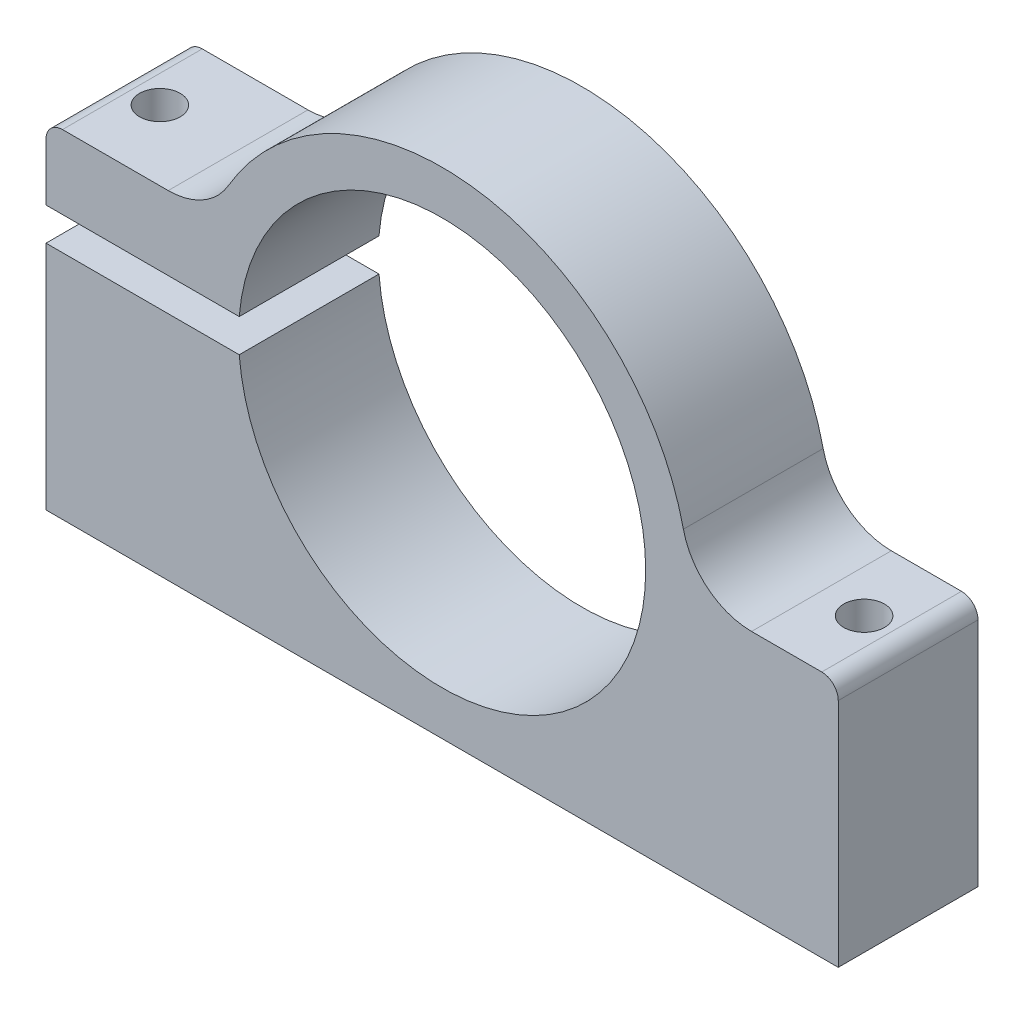
ISO-10303-21;
HEADER;
FILE_DESCRIPTION(('STEP AP214'),'2;1');
FILE_NAME('part.step','',(''),(''),'','','');
FILE_SCHEMA(('AUTOMOTIVE_DESIGN { 1 0 10303 214 1 1 1 1 }'));
ENDSEC;
DATA;
#1=APPLICATION_CONTEXT('core data for automotive mechanical design processes');
#2=APPLICATION_PROTOCOL_DEFINITION('international standard','automotive_design',2000,#1);
#3=PRODUCT_CONTEXT('',#1,'mechanical');
#4=PRODUCT('Part','Part','',(#3));
#5=PRODUCT_RELATED_PRODUCT_CATEGORY('part','',(#4));
#6=PRODUCT_DEFINITION_FORMATION('','',#4);
#7=PRODUCT_DEFINITION_CONTEXT('part definition',#1,'design');
#8=PRODUCT_DEFINITION('design','',#6,#7);
#9=PRODUCT_DEFINITION_SHAPE('','',#8);
#10=(LENGTH_UNIT() NAMED_UNIT(*) SI_UNIT(.MILLI.,.METRE.));
#11=(NAMED_UNIT(*) PLANE_ANGLE_UNIT() SI_UNIT($,.RADIAN.));
#12=(NAMED_UNIT(*) SI_UNIT($,.STERADIAN.) SOLID_ANGLE_UNIT());
#13=UNCERTAINTY_MEASURE_WITH_UNIT(LENGTH_MEASURE(1.E-05),#10,'distance_accuracy_value','');
#14=(GEOMETRIC_REPRESENTATION_CONTEXT(3) GLOBAL_UNCERTAINTY_ASSIGNED_CONTEXT((#13)) GLOBAL_UNIT_ASSIGNED_CONTEXT((#10,
#11,#12)) REPRESENTATION_CONTEXT('',''));
#15=CARTESIAN_POINT('',(0.,0.,0.));
#16=DIRECTION('',(0.,0.,1.));
#17=DIRECTION('',(1.,0.,0.));
#18=AXIS2_PLACEMENT_3D('',#15,#16,#17);
#19=CARTESIAN_POINT('',(-22.4298996876937,1.5,-12.7));
#20=DIRECTION('',(0.,1.,0.));
#21=DIRECTION('',(-1.,0.,0.));
#22=AXIS2_PLACEMENT_3D('',#19,#20,#21);
#23=PLANE('',#22);
#24=CARTESIAN_POINT('',(-32.,1.5,-6.35));
#25=DIRECTION('',(0.,1.,0.));
#26=DIRECTION('',(-1.,0.,0.));
#27=AXIS2_PLACEMENT_3D('',#24,#25,#26);
#28=CIRCLE('',#27,1.85);
#29=CARTESIAN_POINT('',(-33.85,1.5,-6.35));
#30=VERTEX_POINT('',#29);
#31=EDGE_CURVE('E152',#30,#30,#28,.T.);
#32=ORIENTED_EDGE('',*,*,#31,.T.);
#33=EDGE_LOOP('',(#32));
#34=FACE_BOUND('',#33,.T.);
#35=DIRECTION('',(-1.,0.,0.));
#36=VECTOR('',#35,1.);
#37=CARTESIAN_POINT('',(-22.4298996876937,1.5,0.));
#38=LINE('',#37,#36);
#39=CARTESIAN_POINT('',(-18.4390889145858,1.5,0.));
#40=VERTEX_POINT('',#39);
#41=CARTESIAN_POINT('',(-36.,1.5,0.));
#42=VERTEX_POINT('',#41);
#43=EDGE_CURVE('E141',#40,#42,#38,.T.);
#44=ORIENTED_EDGE('',*,*,#43,.T.);
#45=DIRECTION('',(0.,0.,1.));
#46=VECTOR('',#45,1.);
#47=CARTESIAN_POINT('',(-36.,1.5,-12.7));
#48=LINE('',#47,#46);
#49=CARTESIAN_POINT('',(-36.,1.5,-12.7));
#50=VERTEX_POINT('',#49);
#51=EDGE_CURVE('E201',#50,#42,#48,.T.);
#52=ORIENTED_EDGE('',*,*,#51,.F.);
#53=DIRECTION('',(-1.,0.,0.));
#54=VECTOR('',#53,1.);
#55=CARTESIAN_POINT('',(-22.4298996876937,1.5,-12.7));
#56=LINE('',#55,#54);
#57=CARTESIAN_POINT('',(-18.4390889145858,1.50000000000001,-12.7));
#58=VERTEX_POINT('',#57);
#59=EDGE_CURVE('E180',#58,#50,#56,.T.);
#60=ORIENTED_EDGE('',*,*,#59,.F.);
#61=DIRECTION('',(0.,0.,1.));
#62=VECTOR('',#61,1.);
#63=CARTESIAN_POINT('',(-18.4390889145858,1.5,-12.7));
#64=LINE('',#63,#62);
#65=EDGE_CURVE('E151',#58,#40,#64,.T.);
#66=ORIENTED_EDGE('',*,*,#65,.T.);
#67=EDGE_LOOP('',(#44,#52,#60,#66));
#68=FACE_BOUND('',#67,.T.);
#69=ADVANCED_FACE('F30',(#34,#68),#23,.F.);
#70=CARTESIAN_POINT('',(-36.,1.5,-12.7));
#71=DIRECTION('',(1.,0.,0.));
#72=DIRECTION('',(0.,0.,-1.));
#73=AXIS2_PLACEMENT_3D('',#70,#71,#72);
#74=PLANE('',#73);
#75=DIRECTION('',(0.,1.,0.));
#76=VECTOR('',#75,1.);
#77=CARTESIAN_POINT('',(-36.,1.5,0.));
#78=LINE('',#77,#76);
#79=CARTESIAN_POINT('',(-36.,6.69101756633617,0.));
#80=VERTEX_POINT('',#79);
#81=EDGE_CURVE('E198',#42,#80,#78,.T.);
#82=ORIENTED_EDGE('',*,*,#81,.T.);
#83=DIRECTION('',(0.,0.,1.));
#84=VECTOR('',#83,1.);
#85=CARTESIAN_POINT('',(-36.,6.69101756633617,-12.7));
#86=LINE('',#85,#84);
#87=CARTESIAN_POINT('',(-36.,6.69101756633617,-12.7));
#88=VERTEX_POINT('',#87);
#89=EDGE_CURVE('E38',#80,#88,#86,.F.);
#90=ORIENTED_EDGE('',*,*,#89,.T.);
#91=DIRECTION('',(0.,1.,0.));
#92=VECTOR('',#91,1.);
#93=CARTESIAN_POINT('',(-36.,1.5,-12.7));
#94=LINE('',#93,#92);
#95=EDGE_CURVE('E178',#50,#88,#94,.T.);
#96=ORIENTED_EDGE('',*,*,#95,.F.);
#97=ORIENTED_EDGE('',*,*,#51,.T.);
#98=EDGE_LOOP('',(#82,#90,#96,#97));
#99=FACE_BOUND('',#98,.T.);
#100=ADVANCED_FACE('F322',(#99),#74,.F.);
#101=CARTESIAN_POINT('',(-36.,8.19101756633617,-12.7));
#102=DIRECTION('',(0.,-1.,0.));
#103=DIRECTION('',(1.,0.,0.));
#104=AXIS2_PLACEMENT_3D('',#101,#102,#103);
#105=PLANE('',#104);
#106=CARTESIAN_POINT('',(-32.,8.19101756633617,-6.35));
#107=DIRECTION('',(0.,1.,0.));
#108=DIRECTION('',(-1.,0.,0.));
#109=AXIS2_PLACEMENT_3D('',#106,#107,#108);
#110=CIRCLE('',#109,1.85);
#111=CARTESIAN_POINT('',(-33.85,8.19101756633617,-6.35));
#112=VERTEX_POINT('',#111);
#113=EDGE_CURVE('E291',#112,#112,#110,.T.);
#114=ORIENTED_EDGE('',*,*,#113,.F.);
#115=EDGE_LOOP('',(#114));
#116=FACE_BOUND('',#115,.T.);
#117=DIRECTION('',(1.,0.,0.));
#118=VECTOR('',#117,1.);
#119=CARTESIAN_POINT('',(-36.,8.19101756633617,-12.7));
#120=LINE('',#119,#118);
#121=CARTESIAN_POINT('',(-34.5,8.19101756633617,-12.7));
#122=VERTEX_POINT('',#121);
#123=CARTESIAN_POINT('',(-24.8943308432965,8.19101756633617,-12.7));
#124=VERTEX_POINT('',#123);
#125=EDGE_CURVE('E176',#122,#124,#120,.T.);
#126=ORIENTED_EDGE('',*,*,#125,.F.);
#127=DIRECTION('',(0.,0.,1.));
#128=VECTOR('',#127,1.);
#129=CARTESIAN_POINT('',(-34.5,8.19101756633617,-12.7));
#130=LINE('',#129,#128);
#131=CARTESIAN_POINT('',(-34.5,8.19101756633617,0.));
#132=VERTEX_POINT('',#131);
#133=EDGE_CURVE('E243',#122,#132,#130,.T.);
#134=ORIENTED_EDGE('',*,*,#133,.T.);
#135=DIRECTION('',(1.,0.,0.));
#136=VECTOR('',#135,1.);
#137=CARTESIAN_POINT('',(-36.,8.19101756633617,0.));
#138=LINE('',#137,#136);
#139=CARTESIAN_POINT('',(-24.8943308432965,8.19101756633617,0.));
#140=VERTEX_POINT('',#139);
#141=EDGE_CURVE('E196',#132,#140,#138,.T.);
#142=ORIENTED_EDGE('',*,*,#141,.T.);
#143=DIRECTION('',(0.,0.,1.));
#144=VECTOR('',#143,1.);
#145=CARTESIAN_POINT('',(-24.8943308432965,8.19101756633617,-12.7));
#146=LINE('',#145,#144);
#147=EDGE_CURVE('E226',#140,#124,#146,.F.);
#148=ORIENTED_EDGE('',*,*,#147,.T.);
#149=EDGE_LOOP('',(#126,#134,#142,#148));
#150=FACE_BOUND('',#149,.T.);
#151=ADVANCED_FACE('F249',(#116,#150),#105,.F.);
#152=CARTESIAN_POINT('',(0.,0.,-12.7));
#153=DIRECTION('',(0.,0.,1.));
#154=DIRECTION('',(1.,0.,0.));
#155=AXIS2_PLACEMENT_3D('',#152,#153,#154);
#156=CYLINDRICAL_SURFACE('',#155,22.48);
#157=CARTESIAN_POINT('',(0.,0.,-12.7));
#158=DIRECTION('',(0.,0.,1.));
#159=DIRECTION('',(1.,0.,0.));
#160=AXIS2_PLACEMENT_3D('',#157,#158,#159);
#161=CIRCLE('',#160,22.48);
#162=CARTESIAN_POINT('',(21.9279350173925,4.95137010058966,-12.7));
#163=VERTEX_POINT('',#162);
#164=CARTESIAN_POINT('',(-19.4111882538087,11.3382613559222,-12.7));
#165=VERTEX_POINT('',#164);
#166=EDGE_CURVE('E173',#163,#165,#161,.T.);
#167=ORIENTED_EDGE('',*,*,#166,.T.);
#168=DIRECTION('',(0.,0.,1.));
#169=VECTOR('',#168,1.);
#170=CARTESIAN_POINT('',(-19.4111882538087,11.3382613559222,-12.7));
#171=LINE('',#170,#169);
#172=CARTESIAN_POINT('',(-19.4111882538087,11.3382613559222,0.));
#173=VERTEX_POINT('',#172);
#174=EDGE_CURVE('E223',#165,#173,#171,.T.);
#175=ORIENTED_EDGE('',*,*,#174,.T.);
#176=CARTESIAN_POINT('',(0.,0.,0.));
#177=DIRECTION('',(0.,0.,1.));
#178=DIRECTION('',(1.,0.,0.));
#179=AXIS2_PLACEMENT_3D('',#176,#177,#178);
#180=CIRCLE('',#179,22.48);
#181=CARTESIAN_POINT('',(21.9279350173925,4.95137010058966,0.));
#182=VERTEX_POINT('',#181);
#183=EDGE_CURVE('E193',#182,#173,#180,.T.);
#184=ORIENTED_EDGE('',*,*,#183,.F.);
#185=DIRECTION('',(0.,0.,1.));
#186=VECTOR('',#185,1.);
#187=CARTESIAN_POINT('',(21.9279350173925,4.95137010058966,-12.7));
#188=LINE('',#187,#186);
#189=EDGE_CURVE('E216',#182,#163,#188,.F.);
#190=ORIENTED_EDGE('',*,*,#189,.T.);
#191=EDGE_LOOP('',(#167,#175,#184,#190));
#192=FACE_BOUND('',#191,.T.);
#193=ADVANCED_FACE('F262',(#192),#156,.T.);
#194=CARTESIAN_POINT('',(36.,0.,-12.7));
#195=DIRECTION('',(0.,1.,0.));
#196=DIRECTION('',(-1.,0.,0.));
#197=AXIS2_PLACEMENT_3D('',#194,#195,#196);
#198=PLANE('',#197);
#199=CARTESIAN_POINT('',(32.,0.,-6.35));
#200=DIRECTION('',(0.,1.,0.));
#201=DIRECTION('',(-1.,0.,0.));
#202=AXIS2_PLACEMENT_3D('',#199,#200,#201);
#203=CIRCLE('',#202,1.85);
#204=CARTESIAN_POINT('',(30.15,0.,-6.35));
#205=VERTEX_POINT('',#204);
#206=EDGE_CURVE('E297',#205,#205,#203,.T.);
#207=ORIENTED_EDGE('',*,*,#206,.F.);
#208=EDGE_LOOP('',(#207));
#209=FACE_BOUND('',#208,.T.);
#210=DIRECTION('',(-1.,0.,0.));
#211=VECTOR('',#210,1.);
#212=CARTESIAN_POINT('',(36.,0.,0.));
#213=LINE('',#212,#211);
#214=CARTESIAN_POINT('',(34.5,0.,0.));
#215=VERTEX_POINT('',#214);
#216=CARTESIAN_POINT('',(28.1219913946363,0.,0.));
#217=VERTEX_POINT('',#216);
#218=EDGE_CURVE('E191',#215,#217,#213,.T.);
#219=ORIENTED_EDGE('',*,*,#218,.F.);
#220=DIRECTION('',(0.,0.,1.));
#221=VECTOR('',#220,1.);
#222=CARTESIAN_POINT('',(34.5,0.,-12.7));
#223=LINE('',#222,#221);
#224=CARTESIAN_POINT('',(34.5,0.,-12.7));
#225=VERTEX_POINT('',#224);
#226=EDGE_CURVE('E239',#215,#225,#223,.F.);
#227=ORIENTED_EDGE('',*,*,#226,.T.);
#228=DIRECTION('',(-1.,0.,0.));
#229=VECTOR('',#228,1.);
#230=CARTESIAN_POINT('',(36.,0.,-12.7));
#231=LINE('',#230,#229);
#232=CARTESIAN_POINT('',(28.1219913946363,0.,-12.7));
#233=VERTEX_POINT('',#232);
#234=EDGE_CURVE('E171',#225,#233,#231,.T.);
#235=ORIENTED_EDGE('',*,*,#234,.T.);
#236=DIRECTION('',(0.,0.,-1.));
#237=VECTOR('',#236,1.);
#238=CARTESIAN_POINT('',(28.1219913946363,0.,0.));
#239=LINE('',#238,#237);
#240=EDGE_CURVE('E204',#233,#217,#239,.F.);
#241=ORIENTED_EDGE('',*,*,#240,.T.);
#242=EDGE_LOOP('',(#219,#227,#235,#241));
#243=FACE_BOUND('',#242,.T.);
#244=ADVANCED_FACE('F312',(#209,#243),#198,.T.);
#245=CARTESIAN_POINT('',(36.,-22.5,-12.7));
#246=DIRECTION('',(1.,0.,0.));
#247=DIRECTION('',(0.,1.,0.));
#248=AXIS2_PLACEMENT_3D('',#245,#246,#247);
#249=PLANE('',#248);
#250=DIRECTION('',(0.,1.,0.));
#251=VECTOR('',#250,1.);
#252=CARTESIAN_POINT('',(36.,-22.5,-12.7));
#253=LINE('',#252,#251);
#254=CARTESIAN_POINT('',(36.,-22.5,-12.7));
#255=VERTEX_POINT('',#254);
#256=CARTESIAN_POINT('',(36.,-1.5,-12.7));
#257=VERTEX_POINT('',#256);
#258=EDGE_CURVE('E168',#255,#257,#253,.T.);
#259=ORIENTED_EDGE('',*,*,#258,.T.);
#260=DIRECTION('',(0.,0.,1.));
#261=VECTOR('',#260,1.);
#262=CARTESIAN_POINT('',(36.,-1.5,-12.7));
#263=LINE('',#262,#261);
#264=CARTESIAN_POINT('',(36.,-1.5,0.));
#265=VERTEX_POINT('',#264);
#266=EDGE_CURVE('E234',#257,#265,#263,.T.);
#267=ORIENTED_EDGE('',*,*,#266,.T.);
#268=DIRECTION('',(0.,1.,0.));
#269=VECTOR('',#268,1.);
#270=CARTESIAN_POINT('',(36.,-22.5,0.));
#271=LINE('',#270,#269);
#272=CARTESIAN_POINT('',(36.,-22.5,0.));
#273=VERTEX_POINT('',#272);
#274=EDGE_CURVE('E188',#273,#265,#271,.T.);
#275=ORIENTED_EDGE('',*,*,#274,.F.);
#276=DIRECTION('',(0.,0.,1.));
#277=VECTOR('',#276,1.);
#278=CARTESIAN_POINT('',(36.,-22.5,-12.7));
#279=LINE('',#278,#277);
#280=EDGE_CURVE('E205',#255,#273,#279,.T.);
#281=ORIENTED_EDGE('',*,*,#280,.F.);
#282=EDGE_LOOP('',(#259,#267,#275,#281));
#283=FACE_BOUND('',#282,.T.);
#284=ADVANCED_FACE('F278',(#283),#249,.T.);
#285=CARTESIAN_POINT('',(-36.,-22.5,-12.7));
#286=DIRECTION('',(0.,-1.,0.));
#287=DIRECTION('',(0.,0.,-1.));
#288=AXIS2_PLACEMENT_3D('',#285,#286,#287);
#289=PLANE('',#288);
#290=CARTESIAN_POINT('',(32.,-22.5,-6.35));
#291=DIRECTION('',(0.,1.,0.));
#292=DIRECTION('',(-1.,0.,0.));
#293=AXIS2_PLACEMENT_3D('',#290,#291,#292);
#294=CIRCLE('',#293,1.85);
#295=CARTESIAN_POINT('',(30.15,-22.5,-6.35));
#296=VERTEX_POINT('',#295);
#297=EDGE_CURVE('E294',#296,#296,#294,.T.);
#298=ORIENTED_EDGE('',*,*,#297,.T.);
#299=EDGE_LOOP('',(#298));
#300=FACE_BOUND('',#299,.T.);
#301=CARTESIAN_POINT('',(-32.,-22.5,-6.35));
#302=DIRECTION('',(0.,1.,0.));
#303=DIRECTION('',(-1.,0.,0.));
#304=AXIS2_PLACEMENT_3D('',#301,#302,#303);
#305=CIRCLE('',#304,1.85);
#306=CARTESIAN_POINT('',(-33.85,-22.5,-6.35));
#307=VERTEX_POINT('',#306);
#308=EDGE_CURVE('E213',#307,#307,#305,.T.);
#309=ORIENTED_EDGE('',*,*,#308,.T.);
#310=EDGE_LOOP('',(#309));
#311=FACE_BOUND('',#310,.T.);
#312=DIRECTION('',(1.,0.,0.));
#313=VECTOR('',#312,1.);
#314=CARTESIAN_POINT('',(-36.,-22.5,0.));
#315=LINE('',#314,#313);
#316=CARTESIAN_POINT('',(-36.,-22.5,0.));
#317=VERTEX_POINT('',#316);
#318=EDGE_CURVE('E185',#317,#273,#315,.T.);
#319=ORIENTED_EDGE('',*,*,#318,.F.);
#320=DIRECTION('',(0.,0.,1.));
#321=VECTOR('',#320,1.);
#322=CARTESIAN_POINT('',(-36.,-22.5,-12.7));
#323=LINE('',#322,#321);
#324=CARTESIAN_POINT('',(-36.,-22.5,-12.7));
#325=VERTEX_POINT('',#324);
#326=EDGE_CURVE('E207',#325,#317,#323,.T.);
#327=ORIENTED_EDGE('',*,*,#326,.F.);
#328=DIRECTION('',(1.,0.,0.));
#329=VECTOR('',#328,1.);
#330=CARTESIAN_POINT('',(-36.,-22.5,-12.7));
#331=LINE('',#330,#329);
#332=EDGE_CURVE('E165',#325,#255,#331,.T.);
#333=ORIENTED_EDGE('',*,*,#332,.T.);
#334=ORIENTED_EDGE('',*,*,#280,.T.);
#335=EDGE_LOOP('',(#319,#327,#333,#334));
#336=FACE_BOUND('',#335,.T.);
#337=ADVANCED_FACE('F283',(#300,#311,#336),#289,.T.);
#338=CARTESIAN_POINT('',(-36.,-1.5,-12.7));
#339=DIRECTION('',(-1.,0.,0.));
#340=DIRECTION('',(0.,-1.,0.));
#341=AXIS2_PLACEMENT_3D('',#338,#339,#340);
#342=PLANE('',#341);
#343=DIRECTION('',(0.,-1.,0.));
#344=VECTOR('',#343,1.);
#345=CARTESIAN_POINT('',(-36.,-1.5,0.));
#346=LINE('',#345,#344);
#347=CARTESIAN_POINT('',(-36.,-1.5,0.));
#348=VERTEX_POINT('',#347);
#349=EDGE_CURVE('E159',#348,#317,#346,.T.);
#350=ORIENTED_EDGE('',*,*,#349,.F.);
#351=DIRECTION('',(0.,0.,1.));
#352=VECTOR('',#351,1.);
#353=CARTESIAN_POINT('',(-36.,-1.5,-12.7));
#354=LINE('',#353,#352);
#355=CARTESIAN_POINT('',(-36.,-1.5,-12.7));
#356=VERTEX_POINT('',#355);
#357=EDGE_CURVE('E181',#356,#348,#354,.T.);
#358=ORIENTED_EDGE('',*,*,#357,.F.);
#359=DIRECTION('',(0.,-1.,0.));
#360=VECTOR('',#359,1.);
#361=CARTESIAN_POINT('',(-36.,-1.5,-12.7));
#362=LINE('',#361,#360);
#363=EDGE_CURVE('E139',#356,#325,#362,.T.);
#364=ORIENTED_EDGE('',*,*,#363,.T.);
#365=ORIENTED_EDGE('',*,*,#326,.T.);
#366=EDGE_LOOP('',(#350,#358,#364,#365));
#367=FACE_BOUND('',#366,.T.);
#368=ADVANCED_FACE('F285',(#367),#342,.T.);
#369=CARTESIAN_POINT('',(-22.4298996876937,-1.5,-12.7));
#370=DIRECTION('',(0.,1.,0.));
#371=DIRECTION('',(-1.,0.,0.));
#372=AXIS2_PLACEMENT_3D('',#369,#370,#371);
#373=PLANE('',#372);
#374=CARTESIAN_POINT('',(-32.,-1.5,-6.35));
#375=DIRECTION('',(0.,1.,0.));
#376=DIRECTION('',(-1.,0.,0.));
#377=AXIS2_PLACEMENT_3D('',#374,#375,#376);
#378=CIRCLE('',#377,1.85);
#379=CARTESIAN_POINT('',(-33.85,-1.5,-6.35));
#380=VERTEX_POINT('',#379);
#381=EDGE_CURVE('E210',#380,#380,#378,.T.);
#382=ORIENTED_EDGE('',*,*,#381,.F.);
#383=EDGE_LOOP('',(#382));
#384=FACE_BOUND('',#383,.T.);
#385=DIRECTION('',(-1.,0.,0.));
#386=VECTOR('',#385,1.);
#387=CARTESIAN_POINT('',(-22.4298996876937,-1.5,0.));
#388=LINE('',#387,#386);
#389=CARTESIAN_POINT('',(-18.4390889145858,-1.50000000000005,0.));
#390=VERTEX_POINT('',#389);
#391=EDGE_CURVE('E147',#390,#348,#388,.T.);
#392=ORIENTED_EDGE('',*,*,#391,.F.);
#393=DIRECTION('',(0.,0.,1.));
#394=VECTOR('',#393,1.);
#395=CARTESIAN_POINT('',(-18.4390889145858,-1.5,-12.7));
#396=LINE('',#395,#394);
#397=CARTESIAN_POINT('',(-18.4390889145858,-1.5,-12.7));
#398=VERTEX_POINT('',#397);
#399=EDGE_CURVE('E144',#398,#390,#396,.T.);
#400=ORIENTED_EDGE('',*,*,#399,.F.);
#401=DIRECTION('',(-1.,0.,0.));
#402=VECTOR('',#401,1.);
#403=CARTESIAN_POINT('',(-22.4298996876937,-1.5,-12.7));
#404=LINE('',#403,#402);
#405=EDGE_CURVE('E132',#398,#356,#404,.T.);
#406=ORIENTED_EDGE('',*,*,#405,.T.);
#407=ORIENTED_EDGE('',*,*,#357,.T.);
#408=EDGE_LOOP('',(#392,#400,#406,#407));
#409=FACE_BOUND('',#408,.T.);
#410=ADVANCED_FACE('F145',(#384,#409),#373,.T.);
#411=CARTESIAN_POINT('',(0.,0.,-12.7));
#412=DIRECTION('',(0.,0.,1.));
#413=DIRECTION('',(1.,0.,0.));
#414=AXIS2_PLACEMENT_3D('',#411,#412,#413);
#415=PLANE('',#414);
#416=ORIENTED_EDGE('',*,*,#95,.T.);
#417=CARTESIAN_POINT('',(-34.5,6.69101756633617,-12.7));
#418=DIRECTION('',(0.,0.,1.));
#419=DIRECTION('',(1.,0.,0.));
#420=AXIS2_PLACEMENT_3D('',#417,#418,#419);
#421=CIRCLE('',#420,1.5);
#422=EDGE_CURVE('E11',#88,#122,#421,.F.);
#423=ORIENTED_EDGE('',*,*,#422,.T.);
#424=ORIENTED_EDGE('',*,*,#125,.T.);
#425=CARTESIAN_POINT('',(-24.8943308432965,14.5410175663362,-12.7));
#426=DIRECTION('',(0.,0.,1.));
#427=DIRECTION('',(1.,0.,0.));
#428=AXIS2_PLACEMENT_3D('',#425,#426,#427);
#429=CIRCLE('',#428,6.35);
#430=EDGE_CURVE('E232',#124,#165,#429,.T.);
#431=ORIENTED_EDGE('',*,*,#430,.T.);
#432=ORIENTED_EDGE('',*,*,#166,.F.);
#433=CARTESIAN_POINT('',(28.1219913946363,6.35,-12.7));
#434=DIRECTION('',(0.,0.,1.));
#435=DIRECTION('',(1.,0.,0.));
#436=AXIS2_PLACEMENT_3D('',#433,#434,#435);
#437=CIRCLE('',#436,6.35);
#438=EDGE_CURVE('E220',#163,#233,#437,.T.);
#439=ORIENTED_EDGE('',*,*,#438,.T.);
#440=ORIENTED_EDGE('',*,*,#234,.F.);
#441=CARTESIAN_POINT('',(34.5,-1.5,-12.7));
#442=DIRECTION('',(0.,0.,1.));
#443=DIRECTION('',(1.,0.,0.));
#444=AXIS2_PLACEMENT_3D('',#441,#442,#443);
#445=CIRCLE('',#444,1.5);
#446=EDGE_CURVE('E241',#225,#257,#445,.F.);
#447=ORIENTED_EDGE('',*,*,#446,.T.);
#448=ORIENTED_EDGE('',*,*,#258,.F.);
#449=ORIENTED_EDGE('',*,*,#332,.F.);
#450=ORIENTED_EDGE('',*,*,#363,.F.);
#451=ORIENTED_EDGE('',*,*,#405,.F.);
#452=CARTESIAN_POINT('',(0.,0.,-12.7));
#453=DIRECTION('',(0.,0.,1.));
#454=DIRECTION('',(1.,0.,0.));
#455=AXIS2_PLACEMENT_3D('',#452,#453,#454);
#456=CIRCLE('',#455,18.5);
#457=EDGE_CURVE('E136',#398,#58,#456,.T.);
#458=ORIENTED_EDGE('',*,*,#457,.T.);
#459=ORIENTED_EDGE('',*,*,#59,.T.);
#460=EDGE_LOOP('',(#416,#423,#424,#431,#432,#439,#440,#447,#448,#449,#450,#451,#458,#459));
#461=FACE_BOUND('',#460,.T.);
#462=ADVANCED_FACE('F134',(#461),#415,.F.);
#463=CARTESIAN_POINT('',(0.,0.,0.));
#464=DIRECTION('',(0.,0.,1.));
#465=DIRECTION('',(1.,0.,0.));
#466=AXIS2_PLACEMENT_3D('',#463,#464,#465);
#467=PLANE('',#466);
#468=ORIENTED_EDGE('',*,*,#141,.F.);
#469=CARTESIAN_POINT('',(-34.5,6.69101756633617,0.));
#470=DIRECTION('',(0.,0.,1.));
#471=DIRECTION('',(1.,0.,0.));
#472=AXIS2_PLACEMENT_3D('',#469,#470,#471);
#473=CIRCLE('',#472,1.5);
#474=EDGE_CURVE('E52',#132,#80,#473,.T.);
#475=ORIENTED_EDGE('',*,*,#474,.T.);
#476=ORIENTED_EDGE('',*,*,#81,.F.);
#477=ORIENTED_EDGE('',*,*,#43,.F.);
#478=CARTESIAN_POINT('',(0.,0.,0.));
#479=DIRECTION('',(0.,0.,1.));
#480=DIRECTION('',(1.,0.,0.));
#481=AXIS2_PLACEMENT_3D('',#478,#479,#480);
#482=CIRCLE('',#481,18.5);
#483=EDGE_CURVE('E157',#390,#40,#482,.T.);
#484=ORIENTED_EDGE('',*,*,#483,.F.);
#485=ORIENTED_EDGE('',*,*,#391,.T.);
#486=ORIENTED_EDGE('',*,*,#349,.T.);
#487=ORIENTED_EDGE('',*,*,#318,.T.);
#488=ORIENTED_EDGE('',*,*,#274,.T.);
#489=CARTESIAN_POINT('',(34.5,-1.5,0.));
#490=DIRECTION('',(0.,0.,1.));
#491=DIRECTION('',(1.,0.,0.));
#492=AXIS2_PLACEMENT_3D('',#489,#490,#491);
#493=CIRCLE('',#492,1.5);
#494=EDGE_CURVE('E237',#265,#215,#493,.T.);
#495=ORIENTED_EDGE('',*,*,#494,.T.);
#496=ORIENTED_EDGE('',*,*,#218,.T.);
#497=CARTESIAN_POINT('',(28.1219913946363,6.35,0.));
#498=DIRECTION('',(0.,0.,1.));
#499=DIRECTION('',(1.,0.,0.));
#500=AXIS2_PLACEMENT_3D('',#497,#498,#499);
#501=CIRCLE('',#500,6.35);
#502=EDGE_CURVE('E218',#217,#182,#501,.F.);
#503=ORIENTED_EDGE('',*,*,#502,.T.);
#504=ORIENTED_EDGE('',*,*,#183,.T.);
#505=CARTESIAN_POINT('',(-24.8943308432965,14.5410175663362,0.));
#506=DIRECTION('',(0.,0.,1.));
#507=DIRECTION('',(1.,0.,0.));
#508=AXIS2_PLACEMENT_3D('',#505,#506,#507);
#509=CIRCLE('',#508,6.35);
#510=EDGE_CURVE('E229',#173,#140,#509,.F.);
#511=ORIENTED_EDGE('',*,*,#510,.T.);
#512=EDGE_LOOP('',(#468,#475,#476,#477,#484,#485,#486,#487,#488,#495,#496,#503,#504,#511));
#513=FACE_BOUND('',#512,.T.);
#514=ADVANCED_FACE('F252',(#513),#467,.T.);
#515=CARTESIAN_POINT('',(0.,0.,-12.7));
#516=DIRECTION('',(0.,0.,1.));
#517=DIRECTION('',(1.,0.,0.));
#518=AXIS2_PLACEMENT_3D('',#515,#516,#517);
#519=CYLINDRICAL_SURFACE('',#518,18.5);
#520=ORIENTED_EDGE('',*,*,#483,.T.);
#521=ORIENTED_EDGE('',*,*,#65,.F.);
#522=ORIENTED_EDGE('',*,*,#457,.F.);
#523=ORIENTED_EDGE('',*,*,#399,.T.);
#524=EDGE_LOOP('',(#520,#521,#522,#523));
#525=FACE_BOUND('',#524,.T.);
#526=ADVANCED_FACE('F155',(#525),#519,.F.);
#527=CARTESIAN_POINT('',(-32.,-22.5,-6.35));
#528=DIRECTION('',(0.,1.,0.));
#529=DIRECTION('',(-1.,0.,0.));
#530=AXIS2_PLACEMENT_3D('',#527,#528,#529);
#531=CYLINDRICAL_SURFACE('',#530,1.85);
#532=ORIENTED_EDGE('',*,*,#381,.T.);
#533=EDGE_LOOP('',(#532));
#534=FACE_BOUND('',#533,.T.);
#535=ORIENTED_EDGE('',*,*,#308,.F.);
#536=EDGE_LOOP('',(#535));
#537=FACE_BOUND('',#536,.T.);
#538=ADVANCED_FACE('F340',(#534,#537),#531,.F.);
#539=ORIENTED_EDGE('',*,*,#113,.T.);
#540=EDGE_LOOP('',(#539));
#541=FACE_BOUND('',#540,.T.);
#542=ORIENTED_EDGE('',*,*,#31,.F.);
#543=EDGE_LOOP('',(#542));
#544=FACE_BOUND('',#543,.T.);
#545=ADVANCED_FACE('F308',(#541,#544),#531,.F.);
#546=CARTESIAN_POINT('',(32.,-22.5,-6.35));
#547=DIRECTION('',(0.,1.,0.));
#548=DIRECTION('',(-1.,0.,0.));
#549=AXIS2_PLACEMENT_3D('',#546,#547,#548);
#550=CYLINDRICAL_SURFACE('',#549,1.85);
#551=ORIENTED_EDGE('',*,*,#297,.F.);
#552=EDGE_LOOP('',(#551));
#553=FACE_BOUND('',#552,.T.);
#554=ORIENTED_EDGE('',*,*,#206,.T.);
#555=EDGE_LOOP('',(#554));
#556=FACE_BOUND('',#555,.T.);
#557=ADVANCED_FACE('F305',(#553,#556),#550,.F.);
#558=CARTESIAN_POINT('',(28.1219913946363,6.35,-12.7));
#559=DIRECTION('',(0.,0.,1.));
#560=DIRECTION('',(1.,0.,0.));
#561=AXIS2_PLACEMENT_3D('',#558,#559,#560);
#562=CYLINDRICAL_SURFACE('',#561,6.35);
#563=ORIENTED_EDGE('',*,*,#438,.F.);
#564=ORIENTED_EDGE('',*,*,#189,.F.);
#565=ORIENTED_EDGE('',*,*,#502,.F.);
#566=ORIENTED_EDGE('',*,*,#240,.F.);
#567=EDGE_LOOP('',(#563,#564,#565,#566));
#568=FACE_BOUND('',#567,.T.);
#569=ADVANCED_FACE('F266',(#568),#562,.F.);
#570=CARTESIAN_POINT('',(-24.8943308432965,14.5410175663362,-12.7));
#571=DIRECTION('',(0.,0.,1.));
#572=DIRECTION('',(1.,0.,0.));
#573=AXIS2_PLACEMENT_3D('',#570,#571,#572);
#574=CYLINDRICAL_SURFACE('',#573,6.35);
#575=ORIENTED_EDGE('',*,*,#430,.F.);
#576=ORIENTED_EDGE('',*,*,#147,.F.);
#577=ORIENTED_EDGE('',*,*,#510,.F.);
#578=ORIENTED_EDGE('',*,*,#174,.F.);
#579=EDGE_LOOP('',(#575,#576,#577,#578));
#580=FACE_BOUND('',#579,.T.);
#581=ADVANCED_FACE('F258',(#580),#574,.F.);
#582=CARTESIAN_POINT('',(34.5,-1.5,-12.7));
#583=DIRECTION('',(0.,0.,1.));
#584=DIRECTION('',(1.,0.,0.));
#585=AXIS2_PLACEMENT_3D('',#582,#583,#584);
#586=CYLINDRICAL_SURFACE('',#585,1.5);
#587=ORIENTED_EDGE('',*,*,#446,.F.);
#588=ORIENTED_EDGE('',*,*,#226,.F.);
#589=ORIENTED_EDGE('',*,*,#494,.F.);
#590=ORIENTED_EDGE('',*,*,#266,.F.);
#591=EDGE_LOOP('',(#587,#588,#589,#590));
#592=FACE_BOUND('',#591,.T.);
#593=ADVANCED_FACE('F275',(#592),#586,.T.);
#594=CARTESIAN_POINT('',(-34.5,6.69101756633617,-12.7));
#595=DIRECTION('',(0.,0.,1.));
#596=DIRECTION('',(1.,0.,0.));
#597=AXIS2_PLACEMENT_3D('',#594,#595,#596);
#598=CYLINDRICAL_SURFACE('',#597,1.5);
#599=ORIENTED_EDGE('',*,*,#422,.F.);
#600=ORIENTED_EDGE('',*,*,#89,.F.);
#601=ORIENTED_EDGE('',*,*,#474,.F.);
#602=ORIENTED_EDGE('',*,*,#133,.F.);
#603=EDGE_LOOP('',(#599,#600,#601,#602));
#604=FACE_BOUND('',#603,.T.);
#605=ADVANCED_FACE('F32',(#604),#598,.T.);
#606=CLOSED_SHELL('',(#69,#100,#151,#193,#244,#284,#337,#368,#410,#462,#514,#526,#538,#545,#557,
#569,#581,#593,#605));
#607=MANIFOLD_SOLID_BREP('B2',#606);
#608=ADVANCED_BREP_SHAPE_REPRESENTATION('',(#18,#607),#14);
#609=SHAPE_DEFINITION_REPRESENTATION(#9,#608);
ENDSEC;
END-ISO-10303-21;
